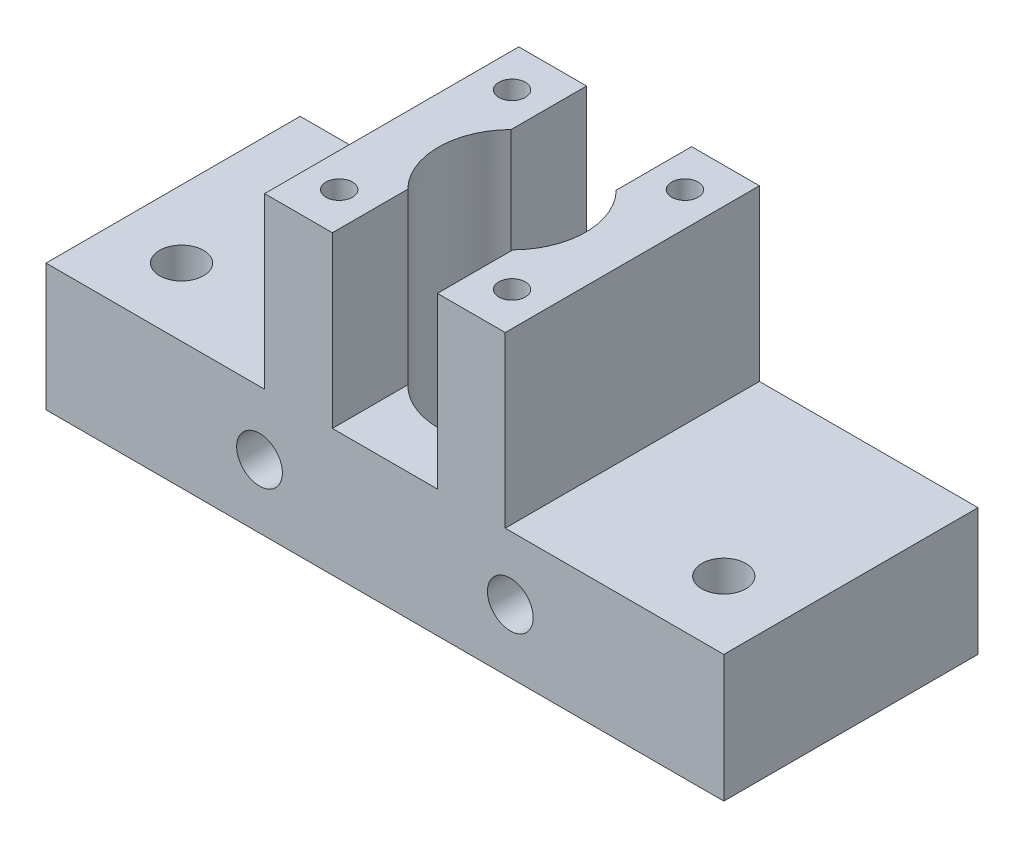
ISO-10303-21;
HEADER;
FILE_DESCRIPTION(('STEP AP214'),'2;1');
FILE_NAME('part.step','',(''),(''),'','','');
FILE_SCHEMA(('AUTOMOTIVE_DESIGN { 1 0 10303 214 1 1 1 1 }'));
ENDSEC;
DATA;
#1=APPLICATION_CONTEXT('core data for automotive mechanical design processes');
#2=APPLICATION_PROTOCOL_DEFINITION('international standard','automotive_design',2000,#1);
#3=PRODUCT_CONTEXT('',#1,'mechanical');
#4=PRODUCT('Part','Part','',(#3));
#5=PRODUCT_RELATED_PRODUCT_CATEGORY('part','',(#4));
#6=PRODUCT_DEFINITION_FORMATION('','',#4);
#7=PRODUCT_DEFINITION_CONTEXT('part definition',#1,'design');
#8=PRODUCT_DEFINITION('design','',#6,#7);
#9=PRODUCT_DEFINITION_SHAPE('','',#8);
#10=(LENGTH_UNIT() NAMED_UNIT(*) SI_UNIT(.MILLI.,.METRE.));
#11=(NAMED_UNIT(*) PLANE_ANGLE_UNIT() SI_UNIT($,.RADIAN.));
#12=(NAMED_UNIT(*) SI_UNIT($,.STERADIAN.) SOLID_ANGLE_UNIT());
#13=UNCERTAINTY_MEASURE_WITH_UNIT(LENGTH_MEASURE(1.E-05),#10,'distance_accuracy_value','');
#14=(GEOMETRIC_REPRESENTATION_CONTEXT(3) GLOBAL_UNCERTAINTY_ASSIGNED_CONTEXT((#13)) GLOBAL_UNIT_ASSIGNED_CONTEXT((#10,
#11,#12)) REPRESENTATION_CONTEXT('',''));
#15=CARTESIAN_POINT('',(0.,0.,0.));
#16=DIRECTION('',(0.,0.,1.));
#17=DIRECTION('',(1.,0.,0.));
#18=AXIS2_PLACEMENT_3D('',#15,#16,#17);
#19=CARTESIAN_POINT('',(0.,44.45,0.));
#20=DIRECTION('',(0.,-1.,0.));
#21=DIRECTION('',(0.,0.,-1.));
#22=AXIS2_PLACEMENT_3D('',#19,#20,#21);
#23=PLANE('',#22);
#24=CARTESIAN_POINT('',(-39.2773268114457,44.45,56.8633427947251));
#25=DIRECTION('',(0.,1.,0.));
#26=DIRECTION('',(0.,0.,1.));
#27=AXIS2_PLACEMENT_3D('',#24,#25,#26);
#28=CIRCLE('',#27,1.9812);
#29=CARTESIAN_POINT('',(-39.2773268114457,44.45,58.8445427947251));
#30=VERTEX_POINT('',#29);
#31=EDGE_CURVE('E197',#30,#30,#28,.T.);
#32=ORIENTED_EDGE('',*,*,#31,.F.);
#33=EDGE_LOOP('',(#32));
#34=FACE_BOUND('',#33,.T.);
#35=CARTESIAN_POINT('',(-39.2773268114457,44.45,30.9553427947251));
#36=DIRECTION('',(0.,1.,0.));
#37=DIRECTION('',(0.,0.,1.));
#38=AXIS2_PLACEMENT_3D('',#35,#36,#37);
#39=CIRCLE('',#38,1.9812);
#40=CARTESIAN_POINT('',(-39.2773268114457,44.45,32.9365427947251));
#41=VERTEX_POINT('',#40);
#42=EDGE_CURVE('E191',#41,#41,#39,.T.);
#43=ORIENTED_EDGE('',*,*,#42,.F.);
#44=EDGE_LOOP('',(#43));
#45=FACE_BOUND('',#44,.T.);
#46=DIRECTION('',(1.,0.,0.));
#47=VECTOR('',#46,1.);
#48=CARTESIAN_POINT('',(-44.3573268114457,44.45,62.9682856855425));
#49=LINE('',#48,#47);
#50=CARTESIAN_POINT('',(-44.3573268114457,44.45,62.9682856855425));
#51=VERTEX_POINT('',#50);
#52=CARTESIAN_POINT('',(-34.1973268114457,44.45,62.9682856855425));
#53=VERTEX_POINT('',#52);
#54=EDGE_CURVE('E224',#51,#53,#49,.T.);
#55=ORIENTED_EDGE('',*,*,#54,.T.);
#56=DIRECTION('',(0.,0.,1.));
#57=VECTOR('',#56,1.);
#58=CARTESIAN_POINT('',(-34.1973268114457,44.45,24.8682856855425));
#59=LINE('',#58,#57);
#60=CARTESIAN_POINT('',(-34.1973268114457,44.45,51.6694485015334));
#61=VERTEX_POINT('',#60);
#62=EDGE_CURVE('E160',#61,#53,#59,.T.);
#63=ORIENTED_EDGE('',*,*,#62,.F.);
#64=CARTESIAN_POINT('',(-26.3233268114457,44.45,43.9182856855425));
#65=DIRECTION('',(0.,1.,0.));
#66=DIRECTION('',(0.,0.,1.));
#67=AXIS2_PLACEMENT_3D('',#64,#65,#66);
#68=CIRCLE('',#67,11.049);
#69=CARTESIAN_POINT('',(-34.1973268114457,44.45,36.1671228695516));
#70=VERTEX_POINT('',#69);
#71=EDGE_CURVE('E209',#70,#61,#68,.T.);
#72=ORIENTED_EDGE('',*,*,#71,.F.);
#73=CARTESIAN_POINT('',(-34.1973268114457,44.45,24.8682856855425));
#74=VERTEX_POINT('',#73);
#75=EDGE_CURVE('E175',#74,#70,#59,.T.);
#76=ORIENTED_EDGE('',*,*,#75,.F.);
#77=DIRECTION('',(-1.,0.,0.));
#78=VECTOR('',#77,1.);
#79=CARTESIAN_POINT('',(-34.1973268114457,44.45,24.8682856855425));
#80=LINE('',#79,#78);
#81=CARTESIAN_POINT('',(-44.3573268114457,44.45,24.8682856855425));
#82=VERTEX_POINT('',#81);
#83=EDGE_CURVE('E221',#74,#82,#80,.T.);
#84=ORIENTED_EDGE('',*,*,#83,.T.);
#85=DIRECTION('',(0.,0.,1.));
#86=VECTOR('',#85,1.);
#87=CARTESIAN_POINT('',(-44.3573268114457,44.45,24.8682856855425));
#88=LINE('',#87,#86);
#89=EDGE_CURVE('E220',#82,#51,#88,.T.);
#90=ORIENTED_EDGE('',*,*,#89,.T.);
#91=EDGE_LOOP('',(#55,#63,#72,#76,#84,#90));
#92=FACE_BOUND('',#91,.T.);
#93=ADVANCED_FACE('F33',(#34,#45,#92),#23,.F.);
#94=CARTESIAN_POINT('',(0.,19.05,0.));
#95=DIRECTION('',(0.,1.,0.));
#96=DIRECTION('',(0.,0.,1.));
#97=AXIS2_PLACEMENT_3D('',#94,#95,#96);
#98=PLANE('',#97);
#99=CARTESIAN_POINT('',(-66.9633268114457,19.05,52.8082856855425));
#100=DIRECTION('',(0.,1.,0.));
#101=DIRECTION('',(0.,0.,1.));
#102=AXIS2_PLACEMENT_3D('',#99,#100,#101);
#103=CIRCLE('',#102,3.302);
#104=CARTESIAN_POINT('',(-66.9633268114457,19.05,56.1102856855425));
#105=VERTEX_POINT('',#104);
#106=EDGE_CURVE('E391',#105,#105,#103,.F.);
#107=ORIENTED_EDGE('',*,*,#106,.T.);
#108=EDGE_LOOP('',(#107));
#109=FACE_BOUND('',#108,.T.);
#110=DIRECTION('',(0.,0.,1.));
#111=VECTOR('',#110,1.);
#112=CARTESIAN_POINT('',(-44.3573268114457,19.05,24.8682856855425));
#113=LINE('',#112,#111);
#114=CARTESIAN_POINT('',(-44.3573268114457,19.05,24.8682856855425));
#115=VERTEX_POINT('',#114);
#116=CARTESIAN_POINT('',(-44.3573268114457,19.05,62.9682856855425));
#117=VERTEX_POINT('',#116);
#118=EDGE_CURVE('E216',#115,#117,#113,.T.);
#119=ORIENTED_EDGE('',*,*,#118,.F.);
#120=DIRECTION('',(-1.,0.,0.));
#121=VECTOR('',#120,1.);
#122=CARTESIAN_POINT('',(-77.1233268114457,19.05,24.8682856855425));
#123=LINE('',#122,#121);
#124=CARTESIAN_POINT('',(-77.1233268114457,19.05,24.8682856855425));
#125=VERTEX_POINT('',#124);
#126=EDGE_CURVE('E302',#115,#125,#123,.T.);
#127=ORIENTED_EDGE('',*,*,#126,.T.);
#128=DIRECTION('',(0.,0.,1.));
#129=VECTOR('',#128,1.);
#130=CARTESIAN_POINT('',(-77.1233268114457,19.05,24.8682856855425));
#131=LINE('',#130,#129);
#132=CARTESIAN_POINT('',(-77.1233268114457,19.05,62.9682856855425));
#133=VERTEX_POINT('',#132);
#134=EDGE_CURVE('E320',#125,#133,#131,.T.);
#135=ORIENTED_EDGE('',*,*,#134,.T.);
#136=DIRECTION('',(1.,0.,0.));
#137=VECTOR('',#136,1.);
#138=CARTESIAN_POINT('',(-77.1233268114457,19.05,62.9682856855425));
#139=LINE('',#138,#137);
#140=EDGE_CURVE('E331',#133,#117,#139,.T.);
#141=ORIENTED_EDGE('',*,*,#140,.T.);
#142=EDGE_LOOP('',(#119,#127,#135,#141));
#143=FACE_BOUND('',#142,.T.);
#144=ADVANCED_FACE('F360',(#109,#143),#98,.T.);
#145=CARTESIAN_POINT('',(-77.1233268114457,19.05,24.8682856855425));
#146=DIRECTION('',(1.,0.,0.));
#147=DIRECTION('',(0.,0.,-1.));
#148=AXIS2_PLACEMENT_3D('',#145,#146,#147);
#149=PLANE('',#148);
#150=DIRECTION('',(0.,0.,1.));
#151=VECTOR('',#150,1.);
#152=CARTESIAN_POINT('',(-77.1233268114457,0.,24.8682856855425));
#153=LINE('',#152,#151);
#154=CARTESIAN_POINT('',(-77.1233268114457,0.,24.8682856855425));
#155=VERTEX_POINT('',#154);
#156=CARTESIAN_POINT('',(-77.1233268114457,0.,62.9682856855425));
#157=VERTEX_POINT('',#156);
#158=EDGE_CURVE('E250',#155,#157,#153,.T.);
#159=ORIENTED_EDGE('',*,*,#158,.T.);
#160=DIRECTION('',(0.,-1.,0.));
#161=VECTOR('',#160,1.);
#162=CARTESIAN_POINT('',(-77.1233268114457,19.05,62.9682856855425));
#163=LINE('',#162,#161);
#164=EDGE_CURVE('E255',#133,#157,#163,.T.);
#165=ORIENTED_EDGE('',*,*,#164,.F.);
#166=ORIENTED_EDGE('',*,*,#134,.F.);
#167=DIRECTION('',(0.,-1.,0.));
#168=VECTOR('',#167,1.);
#169=CARTESIAN_POINT('',(-77.1233268114457,19.05,24.8682856855425));
#170=LINE('',#169,#168);
#171=EDGE_CURVE('E321',#125,#155,#170,.T.);
#172=ORIENTED_EDGE('',*,*,#171,.T.);
#173=EDGE_LOOP('',(#159,#165,#166,#172));
#174=FACE_BOUND('',#173,.T.);
#175=ADVANCED_FACE('F35',(#174),#149,.F.);
#176=CARTESIAN_POINT('',(-77.1233268114457,19.05,62.9682856855425));
#177=DIRECTION('',(0.,0.,-1.));
#178=DIRECTION('',(-1.,0.,0.));
#179=AXIS2_PLACEMENT_3D('',#176,#177,#178);
#180=PLANE('',#179);
#181=CARTESIAN_POINT('',(-45.1193268114457,9.525,62.9682856855425));
#182=DIRECTION('',(0.,0.,-1.));
#183=DIRECTION('',(-1.,0.,0.));
#184=AXIS2_PLACEMENT_3D('',#181,#182,#183);
#185=CIRCLE('',#184,3.429);
#186=CARTESIAN_POINT('',(-48.5483268114457,9.525,62.9682856855425));
#187=VERTEX_POINT('',#186);
#188=EDGE_CURVE('E401',#187,#187,#185,.F.);
#189=ORIENTED_EDGE('',*,*,#188,.F.);
#190=EDGE_LOOP('',(#189));
#191=FACE_BOUND('',#190,.T.);
#192=CARTESIAN_POINT('',(-7.52732681144574,9.525,62.9682856855425));
#193=DIRECTION('',(0.,0.,-1.));
#194=DIRECTION('',(-1.,0.,0.));
#195=AXIS2_PLACEMENT_3D('',#192,#193,#194);
#196=CIRCLE('',#195,3.429);
#197=CARTESIAN_POINT('',(-10.9563268114457,9.525,62.9682856855425));
#198=VERTEX_POINT('',#197);
#199=EDGE_CURVE('E394',#198,#198,#196,.F.);
#200=ORIENTED_EDGE('',*,*,#199,.F.);
#201=EDGE_LOOP('',(#200));
#202=FACE_BOUND('',#201,.T.);
#203=DIRECTION('',(1.,0.,0.));
#204=VECTOR('',#203,1.);
#205=CARTESIAN_POINT('',(-34.1973268114457,19.05,62.9682856855425));
#206=LINE('',#205,#204);
#207=CARTESIAN_POINT('',(-34.1973268114457,19.05,62.9682856855425));
#208=VERTEX_POINT('',#207);
#209=CARTESIAN_POINT('',(-18.4493268114457,19.05,62.9682856855425));
#210=VERTEX_POINT('',#209);
#211=EDGE_CURVE('E148',#208,#210,#206,.T.);
#212=ORIENTED_EDGE('',*,*,#211,.F.);
#213=DIRECTION('',(0.,1.,0.));
#214=VECTOR('',#213,1.);
#215=CARTESIAN_POINT('',(-34.1973268114457,19.05,62.9682856855425));
#216=LINE('',#215,#214);
#217=EDGE_CURVE('E157',#208,#53,#216,.T.);
#218=ORIENTED_EDGE('',*,*,#217,.T.);
#219=ORIENTED_EDGE('',*,*,#54,.F.);
#220=DIRECTION('',(0.,-1.,0.));
#221=VECTOR('',#220,1.);
#222=CARTESIAN_POINT('',(-44.3573268114457,44.45,62.9682856855425));
#223=LINE('',#222,#221);
#224=EDGE_CURVE('E241',#51,#117,#223,.T.);
#225=ORIENTED_EDGE('',*,*,#224,.T.);
#226=ORIENTED_EDGE('',*,*,#140,.F.);
#227=ORIENTED_EDGE('',*,*,#164,.T.);
#228=DIRECTION('',(1.,0.,0.));
#229=VECTOR('',#228,1.);
#230=CARTESIAN_POINT('',(-77.1233268114457,0.,62.9682856855425));
#231=LINE('',#230,#229);
#232=CARTESIAN_POINT('',(24.4766731885543,0.,62.9682856855425));
#233=VERTEX_POINT('',#232);
#234=EDGE_CURVE('E314',#157,#233,#231,.T.);
#235=ORIENTED_EDGE('',*,*,#234,.T.);
#236=DIRECTION('',(0.,-1.,0.));
#237=VECTOR('',#236,1.);
#238=CARTESIAN_POINT('',(24.4766731885543,19.05,62.9682856855425));
#239=LINE('',#238,#237);
#240=CARTESIAN_POINT('',(24.4766731885543,19.05,62.9682856855425));
#241=VERTEX_POINT('',#240);
#242=EDGE_CURVE('E326',#241,#233,#239,.T.);
#243=ORIENTED_EDGE('',*,*,#242,.F.);
#244=CARTESIAN_POINT('',(-8.28932681144573,19.05,62.9682856855425));
#245=VERTEX_POINT('',#244);
#246=EDGE_CURVE('E332',#245,#241,#139,.T.);
#247=ORIENTED_EDGE('',*,*,#246,.F.);
#248=DIRECTION('',(0.,-1.,0.));
#249=VECTOR('',#248,1.);
#250=CARTESIAN_POINT('',(-8.28932681144573,44.45,62.9682856855425));
#251=LINE('',#250,#249);
#252=CARTESIAN_POINT('',(-8.28932681144573,44.45,62.9682856855425));
#253=VERTEX_POINT('',#252);
#254=EDGE_CURVE('E245',#253,#245,#251,.T.);
#255=ORIENTED_EDGE('',*,*,#254,.F.);
#256=CARTESIAN_POINT('',(-18.4493268114457,44.45,62.9682856855425));
#257=VERTEX_POINT('',#256);
#258=EDGE_CURVE('E223',#257,#253,#49,.T.);
#259=ORIENTED_EDGE('',*,*,#258,.F.);
#260=DIRECTION('',(0.,1.,0.));
#261=VECTOR('',#260,1.);
#262=CARTESIAN_POINT('',(-18.4493268114457,19.05,62.9682856855425));
#263=LINE('',#262,#261);
#264=EDGE_CURVE('E164',#210,#257,#263,.T.);
#265=ORIENTED_EDGE('',*,*,#264,.F.);
#266=EDGE_LOOP('',(#212,#218,#219,#225,#226,#227,#235,#243,#247,#255,#259,#265));
#267=FACE_BOUND('',#266,.T.);
#268=ADVANCED_FACE('F167',(#191,#202,#267),#180,.F.);
#269=CARTESIAN_POINT('',(24.4766731885543,19.05,24.8682856855425));
#270=DIRECTION('',(-1.,0.,0.));
#271=DIRECTION('',(0.,0.,1.));
#272=AXIS2_PLACEMENT_3D('',#269,#270,#271);
#273=PLANE('',#272);
#274=DIRECTION('',(0.,0.,-1.));
#275=VECTOR('',#274,1.);
#276=CARTESIAN_POINT('',(24.4766731885543,0.,24.8682856855425));
#277=LINE('',#276,#275);
#278=CARTESIAN_POINT('',(24.4766731885543,0.,24.8682856855425));
#279=VERTEX_POINT('',#278);
#280=EDGE_CURVE('E316',#233,#279,#277,.T.);
#281=ORIENTED_EDGE('',*,*,#280,.T.);
#282=DIRECTION('',(0.,-1.,0.));
#283=VECTOR('',#282,1.);
#284=CARTESIAN_POINT('',(24.4766731885543,19.05,24.8682856855425));
#285=LINE('',#284,#283);
#286=CARTESIAN_POINT('',(24.4766731885543,19.05,24.8682856855425));
#287=VERTEX_POINT('',#286);
#288=EDGE_CURVE('E324',#287,#279,#285,.T.);
#289=ORIENTED_EDGE('',*,*,#288,.F.);
#290=DIRECTION('',(0.,0.,-1.));
#291=VECTOR('',#290,1.);
#292=CARTESIAN_POINT('',(24.4766731885543,19.05,24.8682856855425));
#293=LINE('',#292,#291);
#294=EDGE_CURVE('E305',#241,#287,#293,.T.);
#295=ORIENTED_EDGE('',*,*,#294,.F.);
#296=ORIENTED_EDGE('',*,*,#242,.T.);
#297=EDGE_LOOP('',(#281,#289,#295,#296));
#298=FACE_BOUND('',#297,.T.);
#299=ADVANCED_FACE('F348',(#298),#273,.F.);
#300=CARTESIAN_POINT('',(-77.1233268114457,19.05,24.8682856855425));
#301=DIRECTION('',(0.,0.,1.));
#302=DIRECTION('',(1.,0.,0.));
#303=AXIS2_PLACEMENT_3D('',#300,#301,#302);
#304=PLANE('',#303);
#305=CARTESIAN_POINT('',(-45.1193268114457,9.525,24.8682856855425));
#306=DIRECTION('',(0.,0.,-1.));
#307=DIRECTION('',(-1.,0.,0.));
#308=AXIS2_PLACEMENT_3D('',#305,#306,#307);
#309=CIRCLE('',#308,3.429);
#310=CARTESIAN_POINT('',(-48.5483268114457,9.525,24.8682856855425));
#311=VERTEX_POINT('',#310);
#312=EDGE_CURVE('E404',#311,#311,#309,.T.);
#313=ORIENTED_EDGE('',*,*,#312,.F.);
#314=EDGE_LOOP('',(#313));
#315=FACE_BOUND('',#314,.T.);
#316=CARTESIAN_POINT('',(-7.52732681144574,9.525,24.8682856855425));
#317=DIRECTION('',(0.,0.,-1.));
#318=DIRECTION('',(-1.,0.,0.));
#319=AXIS2_PLACEMENT_3D('',#316,#317,#318);
#320=CIRCLE('',#319,3.429);
#321=CARTESIAN_POINT('',(-10.9563268114457,9.525,24.8682856855425));
#322=VERTEX_POINT('',#321);
#323=EDGE_CURVE('E398',#322,#322,#320,.T.);
#324=ORIENTED_EDGE('',*,*,#323,.F.);
#325=EDGE_LOOP('',(#324));
#326=FACE_BOUND('',#325,.T.);
#327=ORIENTED_EDGE('',*,*,#83,.F.);
#328=DIRECTION('',(0.,1.,0.));
#329=VECTOR('',#328,1.);
#330=CARTESIAN_POINT('',(-34.1973268114457,19.05,24.8682856855425));
#331=LINE('',#330,#329);
#332=CARTESIAN_POINT('',(-34.1973268114457,19.05,24.8682856855425));
#333=VERTEX_POINT('',#332);
#334=EDGE_CURVE('E179',#333,#74,#331,.T.);
#335=ORIENTED_EDGE('',*,*,#334,.F.);
#336=DIRECTION('',(-1.,0.,0.));
#337=VECTOR('',#336,1.);
#338=CARTESIAN_POINT('',(-34.1973268114457,19.05,24.8682856855425));
#339=LINE('',#338,#337);
#340=CARTESIAN_POINT('',(-18.4493268114457,19.05,24.8682856855425));
#341=VERTEX_POINT('',#340);
#342=EDGE_CURVE('E165',#341,#333,#339,.T.);
#343=ORIENTED_EDGE('',*,*,#342,.F.);
#344=DIRECTION('',(0.,1.,0.));
#345=VECTOR('',#344,1.);
#346=CARTESIAN_POINT('',(-18.4493268114457,19.05,24.8682856855425));
#347=LINE('',#346,#345);
#348=CARTESIAN_POINT('',(-18.4493268114457,44.45,24.8682856855425));
#349=VERTEX_POINT('',#348);
#350=EDGE_CURVE('E182',#341,#349,#347,.T.);
#351=ORIENTED_EDGE('',*,*,#350,.T.);
#352=CARTESIAN_POINT('',(-8.28932681144574,44.45,24.8682856855425));
#353=VERTEX_POINT('',#352);
#354=EDGE_CURVE('E217',#353,#349,#80,.T.);
#355=ORIENTED_EDGE('',*,*,#354,.F.);
#356=DIRECTION('',(0.,-1.,0.));
#357=VECTOR('',#356,1.);
#358=CARTESIAN_POINT('',(-8.28932681144574,44.45,24.8682856855425));
#359=LINE('',#358,#357);
#360=CARTESIAN_POINT('',(-8.28932681144574,19.05,24.8682856855425));
#361=VERTEX_POINT('',#360);
#362=EDGE_CURVE('E229',#353,#361,#359,.T.);
#363=ORIENTED_EDGE('',*,*,#362,.T.);
#364=EDGE_CURVE('E293',#287,#361,#123,.T.);
#365=ORIENTED_EDGE('',*,*,#364,.F.);
#366=ORIENTED_EDGE('',*,*,#288,.T.);
#367=DIRECTION('',(-1.,0.,0.));
#368=VECTOR('',#367,1.);
#369=CARTESIAN_POINT('',(-77.1233268114457,0.,24.8682856855425));
#370=LINE('',#369,#368);
#371=EDGE_CURVE('E318',#279,#155,#370,.T.);
#372=ORIENTED_EDGE('',*,*,#371,.T.);
#373=ORIENTED_EDGE('',*,*,#171,.F.);
#374=ORIENTED_EDGE('',*,*,#126,.F.);
#375=DIRECTION('',(0.,-1.,0.));
#376=VECTOR('',#375,1.);
#377=CARTESIAN_POINT('',(-44.3573268114457,44.45,24.8682856855425));
#378=LINE('',#377,#376);
#379=EDGE_CURVE('E244',#82,#115,#378,.T.);
#380=ORIENTED_EDGE('',*,*,#379,.F.);
#381=EDGE_LOOP('',(#327,#335,#343,#351,#355,#363,#365,#366,#372,#373,#374,#380));
#382=FACE_BOUND('',#381,.T.);
#383=ADVANCED_FACE('F273',(#315,#326,#382),#304,.F.);
#384=CARTESIAN_POINT('',(14.3166731885543,19.05,52.8082856855425));
#385=DIRECTION('',(0.,1.,0.));
#386=DIRECTION('',(0.,0.,1.));
#387=AXIS2_PLACEMENT_3D('',#384,#385,#386);
#388=CIRCLE('',#387,3.302);
#389=CARTESIAN_POINT('',(14.3166731885543,19.05,56.1102856855425));
#390=VERTEX_POINT('',#389);
#391=EDGE_CURVE('E384',#390,#390,#388,.F.);
#392=ORIENTED_EDGE('',*,*,#391,.T.);
#393=EDGE_LOOP('',(#392));
#394=FACE_BOUND('',#393,.T.);
#395=DIRECTION('',(0.,0.,-1.));
#396=VECTOR('',#395,1.);
#397=CARTESIAN_POINT('',(-8.28932681144574,19.05,24.8682856855425));
#398=LINE('',#397,#396);
#399=EDGE_CURVE('E238',#245,#361,#398,.T.);
#400=ORIENTED_EDGE('',*,*,#399,.F.);
#401=ORIENTED_EDGE('',*,*,#246,.T.);
#402=ORIENTED_EDGE('',*,*,#294,.T.);
#403=ORIENTED_EDGE('',*,*,#364,.T.);
#404=EDGE_LOOP('',(#400,#401,#402,#403));
#405=FACE_BOUND('',#404,.T.);
#406=ADVANCED_FACE('F342',(#394,#405),#98,.T.);
#407=CARTESIAN_POINT('',(0.,0.,0.));
#408=DIRECTION('',(0.,1.,0.));
#409=DIRECTION('',(0.,0.,1.));
#410=AXIS2_PLACEMENT_3D('',#407,#408,#409);
#411=PLANE('',#410);
#412=CARTESIAN_POINT('',(-66.9633268114457,0.,52.8082856855425));
#413=DIRECTION('',(0.,-1.,0.));
#414=DIRECTION('',(0.,0.,-1.));
#415=AXIS2_PLACEMENT_3D('',#412,#413,#414);
#416=CIRCLE('',#415,3.302);
#417=CARTESIAN_POINT('',(-66.9633268114457,0.,49.5062856855425));
#418=VERTEX_POINT('',#417);
#419=EDGE_CURVE('E387',#418,#418,#416,.T.);
#420=ORIENTED_EDGE('',*,*,#419,.F.);
#421=EDGE_LOOP('',(#420));
#422=FACE_BOUND('',#421,.T.);
#423=CARTESIAN_POINT('',(14.3166731885543,0.,52.8082856855425));
#424=DIRECTION('',(0.,-1.,0.));
#425=DIRECTION('',(0.,0.,-1.));
#426=AXIS2_PLACEMENT_3D('',#423,#424,#425);
#427=CIRCLE('',#426,3.302);
#428=CARTESIAN_POINT('',(14.3166731885543,0.,49.5062856855425));
#429=VERTEX_POINT('',#428);
#430=EDGE_CURVE('E386',#429,#429,#427,.T.);
#431=ORIENTED_EDGE('',*,*,#430,.F.);
#432=EDGE_LOOP('',(#431));
#433=FACE_BOUND('',#432,.T.);
#434=CARTESIAN_POINT('',(-13.3693268114457,0.,30.9553427947251));
#435=DIRECTION('',(0.,1.,0.));
#436=DIRECTION('',(0.,0.,1.));
#437=AXIS2_PLACEMENT_3D('',#434,#435,#436);
#438=CIRCLE('',#437,1.9812);
#439=CARTESIAN_POINT('',(-13.3693268114457,0.,32.9365427947251));
#440=VERTEX_POINT('',#439);
#441=EDGE_CURVE('E188',#440,#440,#438,.F.);
#442=ORIENTED_EDGE('',*,*,#441,.F.);
#443=EDGE_LOOP('',(#442));
#444=FACE_BOUND('',#443,.T.);
#445=CARTESIAN_POINT('',(-39.2773268114457,0.,30.9553427947251));
#446=DIRECTION('',(0.,1.,0.));
#447=DIRECTION('',(0.,0.,1.));
#448=AXIS2_PLACEMENT_3D('',#445,#446,#447);
#449=CIRCLE('',#448,1.9812);
#450=CARTESIAN_POINT('',(-39.2773268114457,0.,32.9365427947251));
#451=VERTEX_POINT('',#450);
#452=EDGE_CURVE('E194',#451,#451,#449,.F.);
#453=ORIENTED_EDGE('',*,*,#452,.F.);
#454=EDGE_LOOP('',(#453));
#455=FACE_BOUND('',#454,.T.);
#456=CARTESIAN_POINT('',(-39.2773268114457,0.,56.8633427947251));
#457=DIRECTION('',(0.,1.,0.));
#458=DIRECTION('',(0.,0.,1.));
#459=AXIS2_PLACEMENT_3D('',#456,#457,#458);
#460=CIRCLE('',#459,1.9812);
#461=CARTESIAN_POINT('',(-39.2773268114457,0.,58.8445427947251));
#462=VERTEX_POINT('',#461);
#463=EDGE_CURVE('E200',#462,#462,#460,.F.);
#464=ORIENTED_EDGE('',*,*,#463,.F.);
#465=EDGE_LOOP('',(#464));
#466=FACE_BOUND('',#465,.T.);
#467=CARTESIAN_POINT('',(-13.3693268114457,0.,56.8633427947251));
#468=DIRECTION('',(0.,1.,0.));
#469=DIRECTION('',(0.,0.,1.));
#470=AXIS2_PLACEMENT_3D('',#467,#468,#469);
#471=CIRCLE('',#470,1.9812);
#472=CARTESIAN_POINT('',(-13.3693268114457,0.,58.8445427947251));
#473=VERTEX_POINT('',#472);
#474=EDGE_CURVE('E206',#473,#473,#471,.F.);
#475=ORIENTED_EDGE('',*,*,#474,.F.);
#476=EDGE_LOOP('',(#475));
#477=FACE_BOUND('',#476,.T.);
#478=CARTESIAN_POINT('',(-26.3233268114457,0.,43.9182856855425));
#479=DIRECTION('',(0.,1.,0.));
#480=DIRECTION('',(0.,0.,1.));
#481=AXIS2_PLACEMENT_3D('',#478,#479,#480);
#482=CIRCLE('',#481,11.049);
#483=CARTESIAN_POINT('',(-26.3233268114457,0.,54.9672856855425));
#484=VERTEX_POINT('',#483);
#485=EDGE_CURVE('E213',#484,#484,#482,.F.);
#486=ORIENTED_EDGE('',*,*,#485,.F.);
#487=EDGE_LOOP('',(#486));
#488=FACE_BOUND('',#487,.T.);
#489=ORIENTED_EDGE('',*,*,#158,.F.);
#490=ORIENTED_EDGE('',*,*,#371,.F.);
#491=ORIENTED_EDGE('',*,*,#280,.F.);
#492=ORIENTED_EDGE('',*,*,#234,.F.);
#493=EDGE_LOOP('',(#489,#490,#491,#492));
#494=FACE_BOUND('',#493,.T.);
#495=ADVANCED_FACE('F353',(#422,#433,#444,#455,#466,#477,#488,#494),#411,.F.);
#496=CARTESIAN_POINT('',(-44.3573268114457,44.45,24.8682856855425));
#497=DIRECTION('',(1.,0.,0.));
#498=DIRECTION('',(0.,0.,-1.));
#499=AXIS2_PLACEMENT_3D('',#496,#497,#498);
#500=PLANE('',#499);
#501=ORIENTED_EDGE('',*,*,#118,.T.);
#502=ORIENTED_EDGE('',*,*,#224,.F.);
#503=ORIENTED_EDGE('',*,*,#89,.F.);
#504=ORIENTED_EDGE('',*,*,#379,.T.);
#505=EDGE_LOOP('',(#501,#502,#503,#504));
#506=FACE_BOUND('',#505,.T.);
#507=ADVANCED_FACE('F358',(#506),#500,.F.);
#508=CARTESIAN_POINT('',(-8.28932681144574,44.45,24.8682856855425));
#509=DIRECTION('',(-1.,0.,0.));
#510=DIRECTION('',(0.,0.,1.));
#511=AXIS2_PLACEMENT_3D('',#508,#509,#510);
#512=PLANE('',#511);
#513=ORIENTED_EDGE('',*,*,#399,.T.);
#514=ORIENTED_EDGE('',*,*,#362,.F.);
#515=DIRECTION('',(0.,0.,-1.));
#516=VECTOR('',#515,1.);
#517=CARTESIAN_POINT('',(-8.28932681144574,44.45,24.8682856855425));
#518=LINE('',#517,#516);
#519=EDGE_CURVE('E226',#253,#353,#518,.T.);
#520=ORIENTED_EDGE('',*,*,#519,.F.);
#521=ORIENTED_EDGE('',*,*,#254,.T.);
#522=EDGE_LOOP('',(#513,#514,#520,#521));
#523=FACE_BOUND('',#522,.T.);
#524=ADVANCED_FACE('F464',(#523),#512,.F.);
#525=CARTESIAN_POINT('',(-13.3693268114457,44.45,30.9553427947251));
#526=DIRECTION('',(0.,1.,0.));
#527=DIRECTION('',(0.,0.,1.));
#528=AXIS2_PLACEMENT_3D('',#525,#526,#527);
#529=CIRCLE('',#528,1.9812);
#530=CARTESIAN_POINT('',(-13.3693268114457,44.45,32.9365427947251));
#531=VERTEX_POINT('',#530);
#532=EDGE_CURVE('E181',#531,#531,#529,.T.);
#533=ORIENTED_EDGE('',*,*,#532,.F.);
#534=EDGE_LOOP('',(#533));
#535=FACE_BOUND('',#534,.T.);
#536=CARTESIAN_POINT('',(-13.3693268114457,44.45,56.8633427947251));
#537=DIRECTION('',(0.,1.,0.));
#538=DIRECTION('',(0.,0.,1.));
#539=AXIS2_PLACEMENT_3D('',#536,#537,#538);
#540=CIRCLE('',#539,1.9812);
#541=CARTESIAN_POINT('',(-13.3693268114457,44.45,58.8445427947251));
#542=VERTEX_POINT('',#541);
#543=EDGE_CURVE('E203',#542,#542,#540,.T.);
#544=ORIENTED_EDGE('',*,*,#543,.F.);
#545=EDGE_LOOP('',(#544));
#546=FACE_BOUND('',#545,.T.);
#547=ORIENTED_EDGE('',*,*,#354,.T.);
#548=DIRECTION('',(0.,0.,-1.));
#549=VECTOR('',#548,1.);
#550=CARTESIAN_POINT('',(-18.4493268114457,44.45,24.8682856855425));
#551=LINE('',#550,#549);
#552=CARTESIAN_POINT('',(-18.4493268114457,44.45,36.1671228695516));
#553=VERTEX_POINT('',#552);
#554=EDGE_CURVE('E177',#553,#349,#551,.T.);
#555=ORIENTED_EDGE('',*,*,#554,.F.);
#556=CARTESIAN_POINT('',(-18.4493268114457,44.45,51.6694485015334));
#557=VERTEX_POINT('',#556);
#558=EDGE_CURVE('E210',#557,#553,#68,.T.);
#559=ORIENTED_EDGE('',*,*,#558,.F.);
#560=EDGE_CURVE('E154',#257,#557,#551,.T.);
#561=ORIENTED_EDGE('',*,*,#560,.F.);
#562=ORIENTED_EDGE('',*,*,#258,.T.);
#563=ORIENTED_EDGE('',*,*,#519,.T.);
#564=EDGE_LOOP('',(#547,#555,#559,#561,#562,#563));
#565=FACE_BOUND('',#564,.T.);
#566=ADVANCED_FACE('F287',(#535,#546,#565),#23,.F.);
#567=CARTESIAN_POINT('',(-26.3233268114457,-0.001000000000001,43.9182856855425));
#568=DIRECTION('',(0.,1.,0.));
#569=DIRECTION('',(0.,0.,1.));
#570=AXIS2_PLACEMENT_3D('',#567,#568,#569);
#571=CYLINDRICAL_SURFACE('',#570,11.049);
#572=CARTESIAN_POINT('',(-26.3233268114457,19.05,43.9182856855425));
#573=DIRECTION('',(0.,1.,0.));
#574=DIRECTION('',(0.,0.,1.));
#575=AXIS2_PLACEMENT_3D('',#572,#573,#574);
#576=CIRCLE('',#575,11.049);
#577=CARTESIAN_POINT('',(-34.1973268114457,19.05,36.1671228695516));
#578=VERTEX_POINT('',#577);
#579=CARTESIAN_POINT('',(-18.4493268114457,19.05,36.1671228695516));
#580=VERTEX_POINT('',#579);
#581=EDGE_CURVE('E256',#578,#580,#576,.F.);
#582=ORIENTED_EDGE('',*,*,#581,.F.);
#583=DIRECTION('',(0.,1.,0.));
#584=VECTOR('',#583,1.);
#585=CARTESIAN_POINT('',(-34.1973268114457,-0.001000000000001,36.1671228695516));
#586=LINE('',#585,#584);
#587=EDGE_CURVE('E11',#578,#70,#586,.T.);
#588=ORIENTED_EDGE('',*,*,#587,.T.);
#589=ORIENTED_EDGE('',*,*,#71,.T.);
#590=DIRECTION('',(0.,1.,0.));
#591=VECTOR('',#590,1.);
#592=CARTESIAN_POINT('',(-34.1973268114457,-0.001000000000001,51.6694485015334));
#593=LINE('',#592,#591);
#594=CARTESIAN_POINT('',(-34.1973268114457,19.05,51.6694485015334));
#595=VERTEX_POINT('',#594);
#596=EDGE_CURVE('E259',#61,#595,#593,.F.);
#597=ORIENTED_EDGE('',*,*,#596,.T.);
#598=CARTESIAN_POINT('',(-18.4493268114457,19.05,51.6694485015334));
#599=VERTEX_POINT('',#598);
#600=EDGE_CURVE('E151',#599,#595,#576,.F.);
#601=ORIENTED_EDGE('',*,*,#600,.F.);
#602=DIRECTION('',(0.,1.,0.));
#603=VECTOR('',#602,1.);
#604=CARTESIAN_POINT('',(-18.4493268114457,-0.001000000000001,51.6694485015334));
#605=LINE('',#604,#603);
#606=EDGE_CURVE('E254',#599,#557,#605,.T.);
#607=ORIENTED_EDGE('',*,*,#606,.T.);
#608=ORIENTED_EDGE('',*,*,#558,.T.);
#609=DIRECTION('',(0.,1.,0.));
#610=VECTOR('',#609,1.);
#611=CARTESIAN_POINT('',(-18.4493268114457,-0.001000000000001,36.1671228695516));
#612=LINE('',#611,#610);
#613=EDGE_CURVE('E41',#553,#580,#612,.F.);
#614=ORIENTED_EDGE('',*,*,#613,.T.);
#615=EDGE_LOOP('',(#582,#588,#589,#597,#601,#607,#608,#614));
#616=FACE_BOUND('',#615,.T.);
#617=ORIENTED_EDGE('',*,*,#485,.T.);
#618=EDGE_LOOP('',(#617));
#619=FACE_BOUND('',#618,.T.);
#620=ADVANCED_FACE('F281',(#616,#619),#571,.F.);
#621=CARTESIAN_POINT('',(-13.3693268114457,-0.001000000000001,56.8633427947251));
#622=DIRECTION('',(0.,1.,0.));
#623=DIRECTION('',(0.,0.,1.));
#624=AXIS2_PLACEMENT_3D('',#621,#622,#623);
#625=CYLINDRICAL_SURFACE('',#624,1.9812);
#626=ORIENTED_EDGE('',*,*,#543,.T.);
#627=EDGE_LOOP('',(#626));
#628=FACE_BOUND('',#627,.T.);
#629=ORIENTED_EDGE('',*,*,#474,.T.);
#630=EDGE_LOOP('',(#629));
#631=FACE_BOUND('',#630,.T.);
#632=ADVANCED_FACE('F456',(#628,#631),#625,.F.);
#633=CARTESIAN_POINT('',(-39.2773268114457,-0.001000000000001,56.8633427947251));
#634=DIRECTION('',(0.,1.,0.));
#635=DIRECTION('',(0.,0.,1.));
#636=AXIS2_PLACEMENT_3D('',#633,#634,#635);
#637=CYLINDRICAL_SURFACE('',#636,1.9812);
#638=ORIENTED_EDGE('',*,*,#31,.T.);
#639=EDGE_LOOP('',(#638));
#640=FACE_BOUND('',#639,.T.);
#641=ORIENTED_EDGE('',*,*,#463,.T.);
#642=EDGE_LOOP('',(#641));
#643=FACE_BOUND('',#642,.T.);
#644=ADVANCED_FACE('F452',(#640,#643),#637,.F.);
#645=CARTESIAN_POINT('',(-39.2773268114457,-0.001000000000001,30.9553427947251));
#646=DIRECTION('',(0.,1.,0.));
#647=DIRECTION('',(0.,0.,1.));
#648=AXIS2_PLACEMENT_3D('',#645,#646,#647);
#649=CYLINDRICAL_SURFACE('',#648,1.9812);
#650=ORIENTED_EDGE('',*,*,#42,.T.);
#651=EDGE_LOOP('',(#650));
#652=FACE_BOUND('',#651,.T.);
#653=ORIENTED_EDGE('',*,*,#452,.T.);
#654=EDGE_LOOP('',(#653));
#655=FACE_BOUND('',#654,.T.);
#656=ADVANCED_FACE('F448',(#652,#655),#649,.F.);
#657=CARTESIAN_POINT('',(-13.3693268114457,-0.001000000000001,30.9553427947251));
#658=DIRECTION('',(0.,1.,0.));
#659=DIRECTION('',(0.,0.,1.));
#660=AXIS2_PLACEMENT_3D('',#657,#658,#659);
#661=CYLINDRICAL_SURFACE('',#660,1.9812);
#662=ORIENTED_EDGE('',*,*,#532,.T.);
#663=EDGE_LOOP('',(#662));
#664=FACE_BOUND('',#663,.T.);
#665=ORIENTED_EDGE('',*,*,#441,.T.);
#666=EDGE_LOOP('',(#665));
#667=FACE_BOUND('',#666,.T.);
#668=ADVANCED_FACE('F445',(#664,#667),#661,.F.);
#669=CARTESIAN_POINT('',(0.,19.05,0.));
#670=DIRECTION('',(0.,1.,0.));
#671=DIRECTION('',(0.,0.,1.));
#672=AXIS2_PLACEMENT_3D('',#669,#670,#671);
#673=PLANE('',#672);
#674=ORIENTED_EDGE('',*,*,#600,.T.);
#675=DIRECTION('',(0.,0.,1.));
#676=VECTOR('',#675,1.);
#677=CARTESIAN_POINT('',(-34.1973268114457,19.05,24.8682856855425));
#678=LINE('',#677,#676);
#679=EDGE_CURVE('E144',#595,#208,#678,.T.);
#680=ORIENTED_EDGE('',*,*,#679,.T.);
#681=ORIENTED_EDGE('',*,*,#211,.T.);
#682=DIRECTION('',(0.,0.,-1.));
#683=VECTOR('',#682,1.);
#684=CARTESIAN_POINT('',(-18.4493268114457,19.05,24.8682856855425));
#685=LINE('',#684,#683);
#686=EDGE_CURVE('E56',#210,#599,#685,.T.);
#687=ORIENTED_EDGE('',*,*,#686,.T.);
#688=EDGE_LOOP('',(#674,#680,#681,#687));
#689=FACE_BOUND('',#688,.T.);
#690=ADVANCED_FACE('F146',(#689),#673,.T.);
#691=CARTESIAN_POINT('',(-18.4493268114457,19.05,24.8682856855425));
#692=DIRECTION('',(1.,0.,0.));
#693=DIRECTION('',(0.,0.,-1.));
#694=AXIS2_PLACEMENT_3D('',#691,#692,#693);
#695=PLANE('',#694);
#696=ORIENTED_EDGE('',*,*,#686,.F.);
#697=ORIENTED_EDGE('',*,*,#264,.T.);
#698=ORIENTED_EDGE('',*,*,#560,.T.);
#699=ORIENTED_EDGE('',*,*,#606,.F.);
#700=EDGE_LOOP('',(#696,#697,#698,#699));
#701=FACE_BOUND('',#700,.T.);
#702=ADVANCED_FACE('F442',(#701),#695,.F.);
#703=CARTESIAN_POINT('',(-34.1973268114457,19.05,24.8682856855425));
#704=DIRECTION('',(-1.,0.,0.));
#705=DIRECTION('',(0.,0.,1.));
#706=AXIS2_PLACEMENT_3D('',#703,#704,#705);
#707=PLANE('',#706);
#708=ORIENTED_EDGE('',*,*,#62,.T.);
#709=ORIENTED_EDGE('',*,*,#217,.F.);
#710=ORIENTED_EDGE('',*,*,#679,.F.);
#711=ORIENTED_EDGE('',*,*,#596,.F.);
#712=EDGE_LOOP('',(#708,#709,#710,#711));
#713=FACE_BOUND('',#712,.T.);
#714=ADVANCED_FACE('F158',(#713),#707,.F.);
#715=EDGE_CURVE('E48',#333,#578,#678,.T.);
#716=ORIENTED_EDGE('',*,*,#715,.F.);
#717=ORIENTED_EDGE('',*,*,#334,.T.);
#718=ORIENTED_EDGE('',*,*,#75,.T.);
#719=ORIENTED_EDGE('',*,*,#587,.F.);
#720=EDGE_LOOP('',(#716,#717,#718,#719));
#721=FACE_BOUND('',#720,.T.);
#722=ADVANCED_FACE('F277',(#721),#707,.F.);
#723=ORIENTED_EDGE('',*,*,#554,.T.);
#724=ORIENTED_EDGE('',*,*,#350,.F.);
#725=EDGE_CURVE('E169',#580,#341,#685,.T.);
#726=ORIENTED_EDGE('',*,*,#725,.F.);
#727=ORIENTED_EDGE('',*,*,#613,.F.);
#728=EDGE_LOOP('',(#723,#724,#726,#727));
#729=FACE_BOUND('',#728,.T.);
#730=ADVANCED_FACE('F267',(#729),#695,.F.);
#731=ORIENTED_EDGE('',*,*,#581,.T.);
#732=ORIENTED_EDGE('',*,*,#725,.T.);
#733=ORIENTED_EDGE('',*,*,#342,.T.);
#734=ORIENTED_EDGE('',*,*,#715,.T.);
#735=EDGE_LOOP('',(#731,#732,#733,#734));
#736=FACE_BOUND('',#735,.T.);
#737=ADVANCED_FACE('F264',(#736),#673,.T.);
#738=CARTESIAN_POINT('',(14.3166731885543,44.451025,52.8082856855425));
#739=DIRECTION('',(0.,-1.,0.));
#740=DIRECTION('',(0.,0.,-1.));
#741=AXIS2_PLACEMENT_3D('',#738,#739,#740);
#742=CYLINDRICAL_SURFACE('',#741,3.302);
#743=ORIENTED_EDGE('',*,*,#391,.F.);
#744=EDGE_LOOP('',(#743));
#745=FACE_BOUND('',#744,.T.);
#746=ORIENTED_EDGE('',*,*,#430,.T.);
#747=EDGE_LOOP('',(#746));
#748=FACE_BOUND('',#747,.T.);
#749=ADVANCED_FACE('F434',(#745,#748),#742,.F.);
#750=CARTESIAN_POINT('',(-66.9633268114457,44.451025,52.8082856855425));
#751=DIRECTION('',(0.,-1.,0.));
#752=DIRECTION('',(0.,0.,-1.));
#753=AXIS2_PLACEMENT_3D('',#750,#751,#752);
#754=CYLINDRICAL_SURFACE('',#753,3.302);
#755=ORIENTED_EDGE('',*,*,#106,.F.);
#756=EDGE_LOOP('',(#755));
#757=FACE_BOUND('',#756,.T.);
#758=ORIENTED_EDGE('',*,*,#419,.T.);
#759=EDGE_LOOP('',(#758));
#760=FACE_BOUND('',#759,.T.);
#761=ADVANCED_FACE('F416',(#757,#760),#754,.F.);
#762=CARTESIAN_POINT('',(-7.52732681144574,9.525,62.9693356855425));
#763=DIRECTION('',(0.,0.,-1.));
#764=DIRECTION('',(-1.,0.,0.));
#765=AXIS2_PLACEMENT_3D('',#762,#763,#764);
#766=CYLINDRICAL_SURFACE('',#765,3.429);
#767=ORIENTED_EDGE('',*,*,#323,.T.);
#768=EDGE_LOOP('',(#767));
#769=FACE_BOUND('',#768,.T.);
#770=ORIENTED_EDGE('',*,*,#199,.T.);
#771=EDGE_LOOP('',(#770));
#772=FACE_BOUND('',#771,.T.);
#773=ADVANCED_FACE('F413',(#769,#772),#766,.F.);
#774=CARTESIAN_POINT('',(-45.1193268114457,9.525,62.9693356855425));
#775=DIRECTION('',(0.,0.,-1.));
#776=DIRECTION('',(-1.,0.,0.));
#777=AXIS2_PLACEMENT_3D('',#774,#775,#776);
#778=CYLINDRICAL_SURFACE('',#777,3.429);
#779=ORIENTED_EDGE('',*,*,#312,.T.);
#780=EDGE_LOOP('',(#779));
#781=FACE_BOUND('',#780,.T.);
#782=ORIENTED_EDGE('',*,*,#188,.T.);
#783=EDGE_LOOP('',(#782));
#784=FACE_BOUND('',#783,.T.);
#785=ADVANCED_FACE('F408',(#781,#784),#778,.F.);
#786=CLOSED_SHELL('',(#93,#144,#175,#268,#299,#383,#406,#495,#507,#524,#566,#620,#632,#644,#656,
#668,#690,#702,#714,#722,#730,#737,#749,#761,#773,#785));
#787=MANIFOLD_SOLID_BREP('B2',#786);
#788=ADVANCED_BREP_SHAPE_REPRESENTATION('',(#18,#787),#14);
#789=SHAPE_DEFINITION_REPRESENTATION(#9,#788);
ENDSEC;
END-ISO-10303-21;
